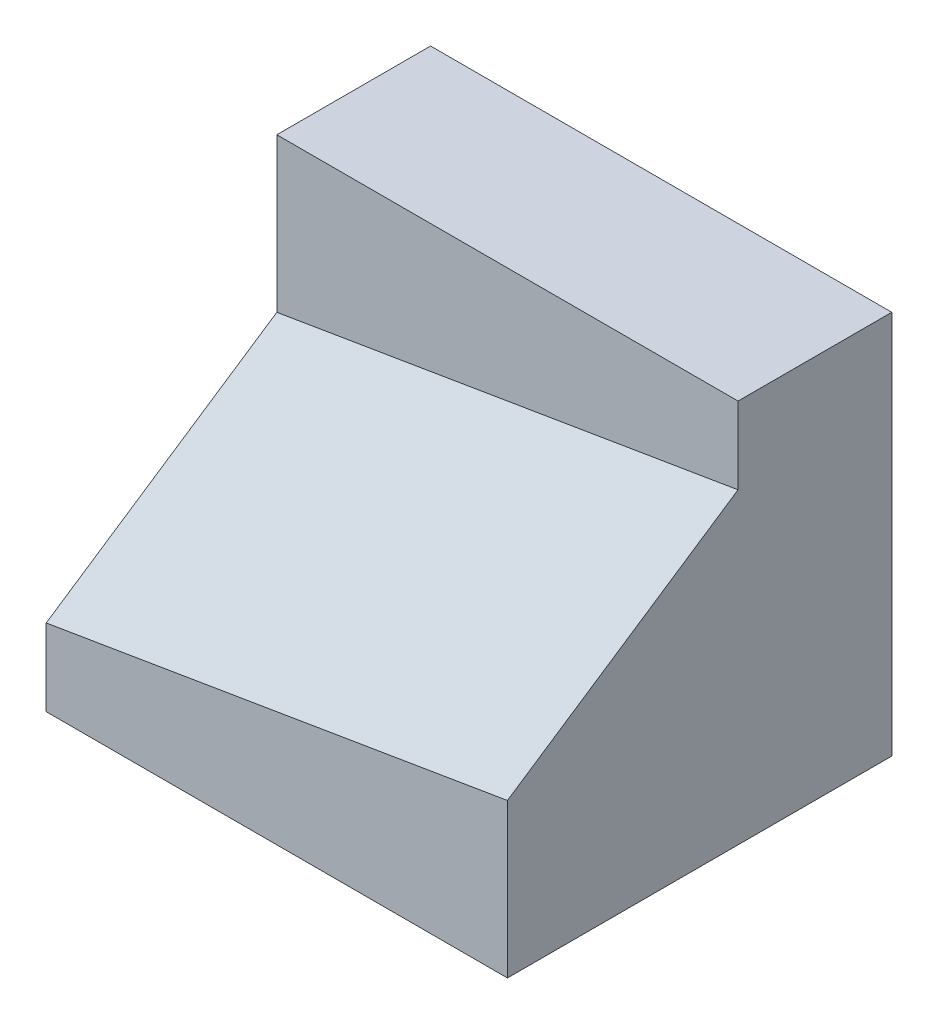
ISO-10303-21;
HEADER;
FILE_DESCRIPTION(('STEP AP214'),'2;1');
FILE_NAME('part.step','',(''),(''),'','','');
FILE_SCHEMA(('AUTOMOTIVE_DESIGN { 1 0 10303 214 1 1 1 1 }'));
ENDSEC;
DATA;
#1=APPLICATION_CONTEXT('core data for automotive mechanical design processes');
#2=APPLICATION_PROTOCOL_DEFINITION('international standard','automotive_design',2000,#1);
#3=PRODUCT_CONTEXT('',#1,'mechanical');
#4=PRODUCT('Part','Part','',(#3));
#5=PRODUCT_RELATED_PRODUCT_CATEGORY('part','',(#4));
#6=PRODUCT_DEFINITION_FORMATION('','',#4);
#7=PRODUCT_DEFINITION_CONTEXT('part definition',#1,'design');
#8=PRODUCT_DEFINITION('design','',#6,#7);
#9=PRODUCT_DEFINITION_SHAPE('','',#8);
#10=(LENGTH_UNIT() NAMED_UNIT(*) SI_UNIT(.MILLI.,.METRE.));
#11=(NAMED_UNIT(*) PLANE_ANGLE_UNIT() SI_UNIT($,.RADIAN.));
#12=(NAMED_UNIT(*) SI_UNIT($,.STERADIAN.) SOLID_ANGLE_UNIT());
#13=UNCERTAINTY_MEASURE_WITH_UNIT(LENGTH_MEASURE(1.E-05),#10,'distance_accuracy_value','');
#14=(GEOMETRIC_REPRESENTATION_CONTEXT(3) GLOBAL_UNCERTAINTY_ASSIGNED_CONTEXT((#13)) GLOBAL_UNIT_ASSIGNED_CONTEXT((#10,
#11,#12)) REPRESENTATION_CONTEXT('',''));
#15=CARTESIAN_POINT('',(0.,0.,0.));
#16=DIRECTION('',(0.,0.,1.));
#17=DIRECTION('',(1.,0.,0.));
#18=AXIS2_PLACEMENT_3D('',#15,#16,#17);
#19=CARTESIAN_POINT('',(0.,25.,25.));
#20=DIRECTION('',(-1.,0.,0.));
#21=DIRECTION('',(0.,0.,1.));
#22=AXIS2_PLACEMENT_3D('',#19,#20,#21);
#23=PLANE('',#22);
#24=DIRECTION('',(0.,-0.554700196225229,0.832050294337844));
#25=VECTOR('',#24,1.);
#26=CARTESIAN_POINT('',(0.,20.,10.));
#27=LINE('',#26,#25);
#28=CARTESIAN_POINT('',(0.,20.,10.));
#29=VERTEX_POINT('',#28);
#30=CARTESIAN_POINT('',(0.,10.,25.));
#31=VERTEX_POINT('',#30);
#32=EDGE_CURVE('E105',#29,#31,#27,.T.);
#33=ORIENTED_EDGE('',*,*,#32,.T.);
#34=DIRECTION('',(0.,1.,0.));
#35=VECTOR('',#34,1.);
#36=CARTESIAN_POINT('',(0.,25.,25.));
#37=LINE('',#36,#35);
#38=CARTESIAN_POINT('',(0.,0.,25.));
#39=VERTEX_POINT('',#38);
#40=EDGE_CURVE('E88',#39,#31,#37,.T.);
#41=ORIENTED_EDGE('',*,*,#40,.F.);
#42=DIRECTION('',(0.,0.,-1.));
#43=VECTOR('',#42,1.);
#44=CARTESIAN_POINT('',(0.,0.,25.));
#45=LINE('',#44,#43);
#46=CARTESIAN_POINT('',(0.,0.,0.));
#47=VERTEX_POINT('',#46);
#48=EDGE_CURVE('E81',#39,#47,#45,.T.);
#49=ORIENTED_EDGE('',*,*,#48,.T.);
#50=DIRECTION('',(0.,1.,0.));
#51=VECTOR('',#50,1.);
#52=CARTESIAN_POINT('',(0.,25.,0.));
#53=LINE('',#52,#51);
#54=CARTESIAN_POINT('',(0.,25.,0.));
#55=VERTEX_POINT('',#54);
#56=EDGE_CURVE('E95',#47,#55,#53,.T.);
#57=ORIENTED_EDGE('',*,*,#56,.T.);
#58=DIRECTION('',(0.,0.,-1.));
#59=VECTOR('',#58,1.);
#60=CARTESIAN_POINT('',(0.,25.,25.));
#61=LINE('',#60,#59);
#62=CARTESIAN_POINT('',(0.,25.,10.));
#63=VERTEX_POINT('',#62);
#64=EDGE_CURVE('E12',#63,#55,#61,.T.);
#65=ORIENTED_EDGE('',*,*,#64,.F.);
#66=DIRECTION('',(0.,1.,0.));
#67=VECTOR('',#66,1.);
#68=CARTESIAN_POINT('',(0.,20.,10.));
#69=LINE('',#68,#67);
#70=EDGE_CURVE('E125',#29,#63,#69,.T.);
#71=ORIENTED_EDGE('',*,*,#70,.F.);
#72=EDGE_LOOP('',(#33,#41,#49,#57,#65,#71));
#73=FACE_BOUND('',#72,.T.);
#74=ADVANCED_FACE('F34',(#73),#23,.F.);
#75=CARTESIAN_POINT('',(-30.,25.,25.));
#76=DIRECTION('',(0.,-1.,0.));
#77=DIRECTION('',(0.,0.,-1.));
#78=AXIS2_PLACEMENT_3D('',#75,#76,#77);
#79=PLANE('',#78);
#80=DIRECTION('',(-1.,0.,0.));
#81=VECTOR('',#80,1.);
#82=CARTESIAN_POINT('',(-30.,25.,10.));
#83=LINE('',#82,#81);
#84=CARTESIAN_POINT('',(-30.,25.,10.));
#85=VERTEX_POINT('',#84);
#86=EDGE_CURVE('E101',#63,#85,#83,.T.);
#87=ORIENTED_EDGE('',*,*,#86,.F.);
#88=ORIENTED_EDGE('',*,*,#64,.T.);
#89=DIRECTION('',(-1.,0.,0.));
#90=VECTOR('',#89,1.);
#91=CARTESIAN_POINT('',(-30.,25.,0.));
#92=LINE('',#91,#90);
#93=CARTESIAN_POINT('',(-30.,25.,0.));
#94=VERTEX_POINT('',#93);
#95=EDGE_CURVE('E100',#55,#94,#92,.T.);
#96=ORIENTED_EDGE('',*,*,#95,.T.);
#97=DIRECTION('',(0.,0.,-1.));
#98=VECTOR('',#97,1.);
#99=CARTESIAN_POINT('',(-30.,25.,25.));
#100=LINE('',#99,#98);
#101=EDGE_CURVE('E43',#85,#94,#100,.T.);
#102=ORIENTED_EDGE('',*,*,#101,.F.);
#103=EDGE_LOOP('',(#87,#88,#96,#102));
#104=FACE_BOUND('',#103,.T.);
#105=ADVANCED_FACE('F150',(#104),#79,.F.);
#106=CARTESIAN_POINT('',(-30.,0.,25.));
#107=DIRECTION('',(1.,0.,0.));
#108=DIRECTION('',(0.,0.,-1.));
#109=AXIS2_PLACEMENT_3D('',#106,#107,#108);
#110=PLANE('',#109);
#111=DIRECTION('',(0.,0.554700196225229,-0.832050294337843));
#112=VECTOR('',#111,1.);
#113=CARTESIAN_POINT('',(-30.,15.,10.));
#114=LINE('',#113,#112);
#115=CARTESIAN_POINT('',(-30.,4.99999999999999,25.));
#116=VERTEX_POINT('',#115);
#117=CARTESIAN_POINT('',(-30.,15.,10.));
#118=VERTEX_POINT('',#117);
#119=EDGE_CURVE('E51',#116,#118,#114,.T.);
#120=ORIENTED_EDGE('',*,*,#119,.T.);
#121=DIRECTION('',(0.,1.,0.));
#122=VECTOR('',#121,1.);
#123=CARTESIAN_POINT('',(-30.,15.,10.));
#124=LINE('',#123,#122);
#125=EDGE_CURVE('E117',#118,#85,#124,.T.);
#126=ORIENTED_EDGE('',*,*,#125,.T.);
#127=ORIENTED_EDGE('',*,*,#101,.T.);
#128=DIRECTION('',(0.,-1.,0.));
#129=VECTOR('',#128,1.);
#130=CARTESIAN_POINT('',(-30.,0.,0.));
#131=LINE('',#130,#129);
#132=CARTESIAN_POINT('',(-30.,0.,0.));
#133=VERTEX_POINT('',#132);
#134=EDGE_CURVE('E89',#94,#133,#131,.T.);
#135=ORIENTED_EDGE('',*,*,#134,.T.);
#136=DIRECTION('',(0.,0.,-1.));
#137=VECTOR('',#136,1.);
#138=CARTESIAN_POINT('',(-30.,0.,25.));
#139=LINE('',#138,#137);
#140=CARTESIAN_POINT('',(-30.,0.,25.));
#141=VERTEX_POINT('',#140);
#142=EDGE_CURVE('E84',#141,#133,#139,.T.);
#143=ORIENTED_EDGE('',*,*,#142,.F.);
#144=DIRECTION('',(0.,-1.,0.));
#145=VECTOR('',#144,1.);
#146=CARTESIAN_POINT('',(-30.,0.,25.));
#147=LINE('',#146,#145);
#148=EDGE_CURVE('E37',#116,#141,#147,.T.);
#149=ORIENTED_EDGE('',*,*,#148,.F.);
#150=EDGE_LOOP('',(#120,#126,#127,#135,#143,#149));
#151=FACE_BOUND('',#150,.T.);
#152=ADVANCED_FACE('F152',(#151),#110,.F.);
#153=CARTESIAN_POINT('',(0.,0.,25.));
#154=DIRECTION('',(0.,0.,-1.));
#155=DIRECTION('',(-1.,0.,0.));
#156=AXIS2_PLACEMENT_3D('',#153,#154,#155);
#157=PLANE('',#156);
#158=DIRECTION('',(-0.986393923832144,-0.164398987305357,0.));
#159=VECTOR('',#158,1.);
#160=CARTESIAN_POINT('',(0.,10.,25.));
#161=LINE('',#160,#159);
#162=EDGE_CURVE('E124',#31,#116,#161,.T.);
#163=ORIENTED_EDGE('',*,*,#162,.T.);
#164=ORIENTED_EDGE('',*,*,#148,.T.);
#165=DIRECTION('',(1.,0.,0.));
#166=VECTOR('',#165,1.);
#167=CARTESIAN_POINT('',(0.,0.,25.));
#168=LINE('',#167,#166);
#169=EDGE_CURVE('E60',#141,#39,#168,.T.);
#170=ORIENTED_EDGE('',*,*,#169,.T.);
#171=ORIENTED_EDGE('',*,*,#40,.T.);
#172=EDGE_LOOP('',(#163,#164,#170,#171));
#173=FACE_BOUND('',#172,.T.);
#174=ADVANCED_FACE('F160',(#173),#157,.F.);
#175=CARTESIAN_POINT('',(0.,0.,25.));
#176=DIRECTION('',(0.,1.,0.));
#177=DIRECTION('',(-1.,0.,0.));
#178=AXIS2_PLACEMENT_3D('',#175,#176,#177);
#179=PLANE('',#178);
#180=DIRECTION('',(1.,0.,0.));
#181=VECTOR('',#180,1.);
#182=CARTESIAN_POINT('',(0.,0.,0.));
#183=LINE('',#182,#181);
#184=EDGE_CURVE('E78',#133,#47,#183,.T.);
#185=ORIENTED_EDGE('',*,*,#184,.T.);
#186=ORIENTED_EDGE('',*,*,#48,.F.);
#187=ORIENTED_EDGE('',*,*,#169,.F.);
#188=ORIENTED_EDGE('',*,*,#142,.T.);
#189=EDGE_LOOP('',(#185,#186,#187,#188));
#190=FACE_BOUND('',#189,.T.);
#191=ADVANCED_FACE('F80',(#190),#179,.F.);
#192=CARTESIAN_POINT('',(0.,0.,0.));
#193=DIRECTION('',(0.,0.,-1.));
#194=DIRECTION('',(-1.,0.,0.));
#195=AXIS2_PLACEMENT_3D('',#192,#193,#194);
#196=PLANE('',#195);
#197=ORIENTED_EDGE('',*,*,#56,.F.);
#198=ORIENTED_EDGE('',*,*,#184,.F.);
#199=ORIENTED_EDGE('',*,*,#134,.F.);
#200=ORIENTED_EDGE('',*,*,#95,.F.);
#201=EDGE_LOOP('',(#197,#198,#199,#200));
#202=FACE_BOUND('',#201,.T.);
#203=ADVANCED_FACE('F98',(#202),#196,.T.);
#204=CARTESIAN_POINT('',(-30.,15.,10.));
#205=DIRECTION('',(0.,0.,1.));
#206=DIRECTION('',(1.,0.,0.));
#207=AXIS2_PLACEMENT_3D('',#204,#205,#206);
#208=PLANE('',#207);
#209=ORIENTED_EDGE('',*,*,#86,.T.);
#210=ORIENTED_EDGE('',*,*,#125,.F.);
#211=DIRECTION('',(0.986393923832144,0.164398987305357,0.));
#212=VECTOR('',#211,1.);
#213=CARTESIAN_POINT('',(-30.,15.,10.));
#214=LINE('',#213,#212);
#215=EDGE_CURVE('E120',#118,#29,#214,.T.);
#216=ORIENTED_EDGE('',*,*,#215,.T.);
#217=ORIENTED_EDGE('',*,*,#70,.T.);
#218=EDGE_LOOP('',(#209,#210,#216,#217));
#219=FACE_BOUND('',#218,.T.);
#220=ADVANCED_FACE('F143',(#219),#208,.T.);
#221=CARTESIAN_POINT('',(-3.01886792452831,18.1132075471698,12.0754716981132));
#222=DIRECTION('',(-0.137360563948689,0.824163383692134,0.549442255794756));
#223=DIRECTION('',(0.,-0.554700196225229,0.832050294337844));
#224=AXIS2_PLACEMENT_3D('',#221,#222,#223);
#225=PLANE('',#224);
#226=ORIENTED_EDGE('',*,*,#32,.F.);
#227=ORIENTED_EDGE('',*,*,#215,.F.);
#228=ORIENTED_EDGE('',*,*,#119,.F.);
#229=ORIENTED_EDGE('',*,*,#162,.F.);
#230=EDGE_LOOP('',(#226,#227,#228,#229));
#231=FACE_BOUND('',#230,.T.);
#232=ADVANCED_FACE('F159',(#231),#225,.T.);
#233=CLOSED_SHELL('',(#74,#105,#152,#174,#191,#203,#220,#232));
#234=MANIFOLD_SOLID_BREP('B2',#233);
#235=ADVANCED_BREP_SHAPE_REPRESENTATION('',(#18,#234),#14);
#236=SHAPE_DEFINITION_REPRESENTATION(#9,#235);
ENDSEC;
END-ISO-10303-21;
